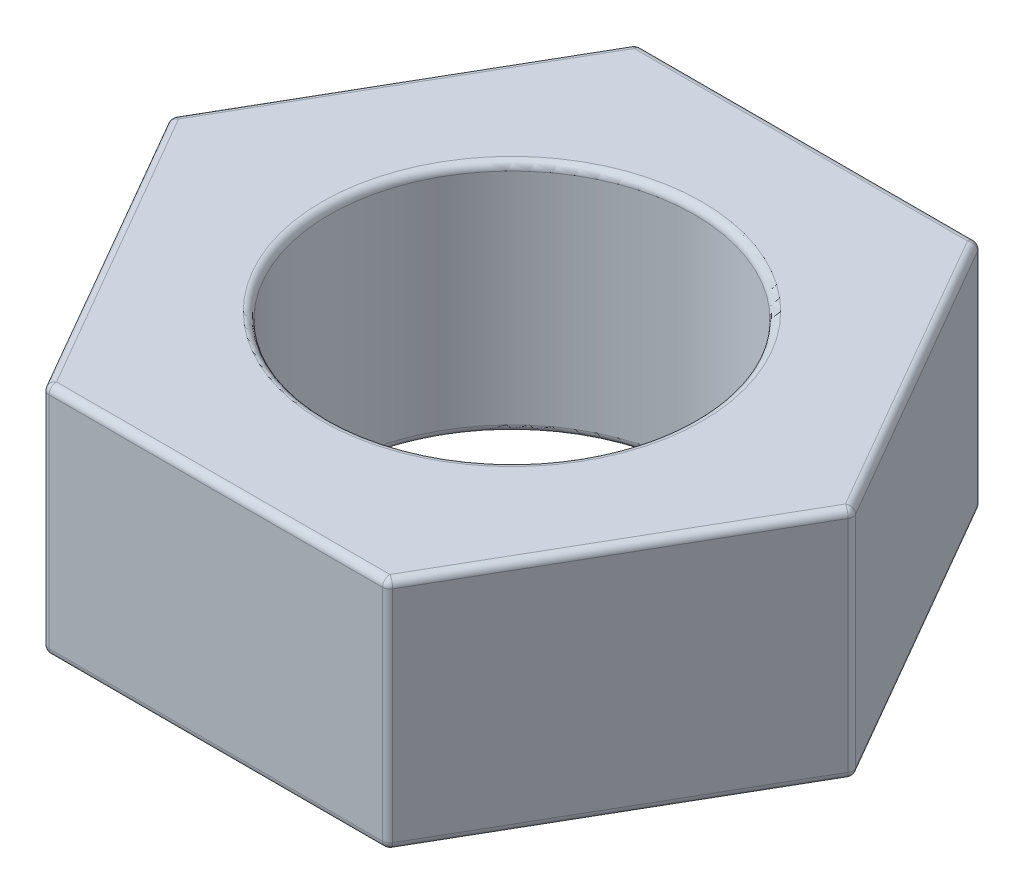
ISO-10303-21;
HEADER;
FILE_DESCRIPTION(('STEP AP214'),'2;1');
FILE_NAME('part.step','',(''),(''),'','','');
FILE_SCHEMA(('AUTOMOTIVE_DESIGN { 1 0 10303 214 1 1 1 1 }'));
ENDSEC;
DATA;
#1=APPLICATION_CONTEXT('core data for automotive mechanical design processes');
#2=APPLICATION_PROTOCOL_DEFINITION('international standard','automotive_design',2000,#1);
#3=PRODUCT_CONTEXT('',#1,'mechanical');
#4=PRODUCT('Part','Part','',(#3));
#5=PRODUCT_RELATED_PRODUCT_CATEGORY('part','',(#4));
#6=PRODUCT_DEFINITION_FORMATION('','',#4);
#7=PRODUCT_DEFINITION_CONTEXT('part definition',#1,'design');
#8=PRODUCT_DEFINITION('design','',#6,#7);
#9=PRODUCT_DEFINITION_SHAPE('','',#8);
#10=(LENGTH_UNIT() NAMED_UNIT(*) SI_UNIT(.MILLI.,.METRE.));
#11=(NAMED_UNIT(*) PLANE_ANGLE_UNIT() SI_UNIT($,.RADIAN.));
#12=(NAMED_UNIT(*) SI_UNIT($,.STERADIAN.) SOLID_ANGLE_UNIT());
#13=UNCERTAINTY_MEASURE_WITH_UNIT(LENGTH_MEASURE(1.E-05),#10,'distance_accuracy_value','');
#14=(GEOMETRIC_REPRESENTATION_CONTEXT(3) GLOBAL_UNCERTAINTY_ASSIGNED_CONTEXT((#13)) GLOBAL_UNIT_ASSIGNED_CONTEXT((#10,
#11,#12)) REPRESENTATION_CONTEXT('',''));
#15=CARTESIAN_POINT('',(0.,0.,0.));
#16=DIRECTION('',(0.,0.,1.));
#17=DIRECTION('',(1.,0.,0.));
#18=AXIS2_PLACEMENT_3D('',#15,#16,#17);
#19=CARTESIAN_POINT('',(2.2372322931098,0.0999999999999998,-3.875));
#20=DIRECTION('',(1.,0.,0.));
#21=DIRECTION('',(0.,0.,-1.));
#22=AXIS2_PLACEMENT_3D('',#19,#20,#21);
#23=SPHERICAL_SURFACE('',#22,0.1);
#24=CARTESIAN_POINT('',(2.2372322931098,0.0999999999999998,-3.875));
#25=DIRECTION('',(-1.,0.,0.));
#26=DIRECTION('',(0.,0.,1.));
#27=AXIS2_PLACEMENT_3D('',#24,#25,#26);
#28=CIRCLE('',#27,0.0999999999999998);
#29=CARTESIAN_POINT('',(2.2372322931098,0.0999999999999998,-3.975));
#30=VERTEX_POINT('',#29);
#31=CARTESIAN_POINT('',(2.2372322931098,0.,-3.875));
#32=VERTEX_POINT('',#31);
#33=EDGE_CURVE('E85',#30,#32,#28,.T.);
#34=ORIENTED_EDGE('',*,*,#33,.F.);
#35=CARTESIAN_POINT('',(2.2372322931098,0.0999999999999998,-3.875));
#36=DIRECTION('',(0.,-1.,0.));
#37=DIRECTION('',(0.,0.,-1.));
#38=AXIS2_PLACEMENT_3D('',#35,#36,#37);
#39=CIRCLE('',#38,0.0999999999999998);
#40=CARTESIAN_POINT('',(2.32383483348825,0.0999999999999998,-3.925));
#41=VERTEX_POINT('',#40);
#42=EDGE_CURVE('E199',#41,#30,#39,.F.);
#43=ORIENTED_EDGE('',*,*,#42,.F.);
#44=CARTESIAN_POINT('',(2.2372322931098,0.0999999999999998,-3.875));
#45=DIRECTION('',(-0.5,0.,-0.866025403784439));
#46=DIRECTION('',(-0.866025403784439,0.,0.5));
#47=AXIS2_PLACEMENT_3D('',#44,#45,#46);
#48=CIRCLE('',#47,0.1);
#49=EDGE_CURVE('E330',#32,#41,#48,.F.);
#50=ORIENTED_EDGE('',*,*,#49,.F.);
#51=EDGE_LOOP('',(#34,#43,#50));
#52=FACE_BOUND('',#51,.T.);
#53=ADVANCED_FACE('F16',(#52),#23,.T.);
#54=CARTESIAN_POINT('',(-2.2372322931098,0.0999999999999998,-3.875));
#55=DIRECTION('',(1.,0.,0.));
#56=DIRECTION('',(0.,0.,-1.));
#57=AXIS2_PLACEMENT_3D('',#54,#55,#56);
#58=SPHERICAL_SURFACE('',#57,0.1);
#59=CARTESIAN_POINT('',(-2.2372322931098,0.0999999999999998,-3.875));
#60=DIRECTION('',(-0.5,0.,0.866025403784439));
#61=DIRECTION('',(0.866025403784439,0.,0.5));
#62=AXIS2_PLACEMENT_3D('',#59,#60,#61);
#63=CIRCLE('',#62,0.1);
#64=CARTESIAN_POINT('',(-2.32383483348825,0.0999999999999985,-3.925));
#65=VERTEX_POINT('',#64);
#66=CARTESIAN_POINT('',(-2.2372322931098,0.,-3.875));
#67=VERTEX_POINT('',#66);
#68=EDGE_CURVE('E409',#65,#67,#63,.T.);
#69=ORIENTED_EDGE('',*,*,#68,.F.);
#70=CARTESIAN_POINT('',(-2.2372322931098,0.0999999999999998,-3.875));
#71=DIRECTION('',(0.,-1.,0.));
#72=DIRECTION('',(0.,0.,-1.));
#73=AXIS2_PLACEMENT_3D('',#70,#71,#72);
#74=CIRCLE('',#73,0.0999999999999998);
#75=CARTESIAN_POINT('',(-2.2372322931098,0.0999999999999998,-3.975));
#76=VERTEX_POINT('',#75);
#77=EDGE_CURVE('E311',#76,#65,#74,.F.);
#78=ORIENTED_EDGE('',*,*,#77,.F.);
#79=CARTESIAN_POINT('',(-2.2372322931098,0.0999999999999998,-3.875));
#80=DIRECTION('',(-1.,0.,0.));
#81=DIRECTION('',(0.,0.,1.));
#82=AXIS2_PLACEMENT_3D('',#79,#80,#81);
#83=CIRCLE('',#82,0.0999999999999998);
#84=EDGE_CURVE('E318',#67,#76,#83,.F.);
#85=ORIENTED_EDGE('',*,*,#84,.F.);
#86=EDGE_LOOP('',(#69,#78,#85));
#87=FACE_BOUND('',#86,.T.);
#88=ADVANCED_FACE('F539',(#87),#58,.T.);
#89=CARTESIAN_POINT('',(-4.4744645862196,0.0999999999999998,0.));
#90=DIRECTION('',(1.,0.,0.));
#91=DIRECTION('',(0.,0.,-1.));
#92=AXIS2_PLACEMENT_3D('',#89,#90,#91);
#93=SPHERICAL_SURFACE('',#92,0.1);
#94=CARTESIAN_POINT('',(-4.4744645862196,0.0999999999999998,0.));
#95=DIRECTION('',(0.,-1.,0.));
#96=DIRECTION('',(0.,0.,-1.));
#97=AXIS2_PLACEMENT_3D('',#94,#95,#96);
#98=CIRCLE('',#97,0.1);
#99=CARTESIAN_POINT('',(-4.5744645862196,0.0999999999999998,0.));
#100=VERTEX_POINT('',#99);
#101=CARTESIAN_POINT('',(-4.56106712659804,0.0999999999999998,0.0499999999999995));
#102=VERTEX_POINT('',#101);
#103=EDGE_CURVE('E37',#100,#102,#98,.F.);
#104=ORIENTED_EDGE('',*,*,#103,.F.);
#105=CARTESIAN_POINT('',(-4.4744645862196,0.0999999999999998,0.));
#106=DIRECTION('',(0.,-1.,0.));
#107=DIRECTION('',(0.,0.,-1.));
#108=AXIS2_PLACEMENT_3D('',#105,#106,#107);
#109=CIRCLE('',#108,0.1);
#110=CARTESIAN_POINT('',(-4.56106712659804,0.099999999999999,-0.0499999999999993));
#111=VERTEX_POINT('',#110);
#112=EDGE_CURVE('E296',#111,#100,#109,.F.);
#113=ORIENTED_EDGE('',*,*,#112,.F.);
#114=CARTESIAN_POINT('',(-4.4744645862196,0.0999999999999998,0.));
#115=DIRECTION('',(-0.5,0.,0.866025403784439));
#116=DIRECTION('',(0.866025403784439,0.,0.5));
#117=AXIS2_PLACEMENT_3D('',#114,#115,#116);
#118=CIRCLE('',#117,0.1);
#119=CARTESIAN_POINT('',(-4.4744645862196,0.,0.));
#120=VERTEX_POINT('',#119);
#121=EDGE_CURVE('E412',#120,#111,#118,.F.);
#122=ORIENTED_EDGE('',*,*,#121,.F.);
#123=CARTESIAN_POINT('',(-4.4744645862196,0.0999999999999998,0.));
#124=DIRECTION('',(0.5,0.,0.866025403784439));
#125=DIRECTION('',(0.866025403784439,0.,-0.5));
#126=AXIS2_PLACEMENT_3D('',#123,#124,#125);
#127=CIRCLE('',#126,0.1);
#128=EDGE_CURVE('E406',#102,#120,#127,.T.);
#129=ORIENTED_EDGE('',*,*,#128,.F.);
#130=EDGE_LOOP('',(#104,#113,#122,#129));
#131=FACE_BOUND('',#130,.T.);
#132=ADVANCED_FACE('F630',(#131),#93,.T.);
#133=CARTESIAN_POINT('',(-2.2372322931098,0.0999999999999998,3.875));
#134=DIRECTION('',(1.,0.,0.));
#135=DIRECTION('',(0.,0.,-1.));
#136=AXIS2_PLACEMENT_3D('',#133,#134,#135);
#137=SPHERICAL_SURFACE('',#136,0.1);
#138=CARTESIAN_POINT('',(-2.2372322931098,0.0999999999999998,3.875));
#139=DIRECTION('',(1.,0.,0.));
#140=DIRECTION('',(0.,0.,-1.));
#141=AXIS2_PLACEMENT_3D('',#138,#139,#140);
#142=CIRCLE('',#141,0.0999999999999998);
#143=CARTESIAN_POINT('',(-2.2372322931098,0.0999999999999998,3.975));
#144=VERTEX_POINT('',#143);
#145=CARTESIAN_POINT('',(-2.2372322931098,0.,3.875));
#146=VERTEX_POINT('',#145);
#147=EDGE_CURVE('E286',#144,#146,#142,.T.);
#148=ORIENTED_EDGE('',*,*,#147,.F.);
#149=CARTESIAN_POINT('',(-2.2372322931098,0.0999999999999998,3.875));
#150=DIRECTION('',(0.,-1.,0.));
#151=DIRECTION('',(0.,0.,-1.));
#152=AXIS2_PLACEMENT_3D('',#149,#150,#151);
#153=CIRCLE('',#152,0.0999999999999998);
#154=CARTESIAN_POINT('',(-2.32383483348824,0.0999999999999998,3.925));
#155=VERTEX_POINT('',#154);
#156=EDGE_CURVE('E273',#155,#144,#153,.F.);
#157=ORIENTED_EDGE('',*,*,#156,.F.);
#158=CARTESIAN_POINT('',(-2.2372322931098,0.0999999999999998,3.875));
#159=DIRECTION('',(0.5,0.,0.866025403784439));
#160=DIRECTION('',(0.866025403784439,0.,-0.5));
#161=AXIS2_PLACEMENT_3D('',#158,#159,#160);
#162=CIRCLE('',#161,0.1);
#163=EDGE_CURVE('E298',#146,#155,#162,.F.);
#164=ORIENTED_EDGE('',*,*,#163,.F.);
#165=EDGE_LOOP('',(#148,#157,#164));
#166=FACE_BOUND('',#165,.T.);
#167=ADVANCED_FACE('F617',(#166),#137,.T.);
#168=CARTESIAN_POINT('',(0.,0.,0.));
#169=DIRECTION('',(0.,1.,0.));
#170=DIRECTION('',(0.,0.,1.));
#171=AXIS2_PLACEMENT_3D('',#168,#169,#170);
#172=PLANE('',#171);
#173=DIRECTION('',(0.5,0.,0.866025403784439));
#174=VECTOR('',#173,1.);
#175=CARTESIAN_POINT('',(-4.50333209967908,0.,-0.0499999999999997));
#176=LINE('',#175,#174);
#177=EDGE_CURVE('E405',#120,#146,#176,.T.);
#178=ORIENTED_EDGE('',*,*,#177,.F.);
#179=DIRECTION('',(-0.5,0.,0.866025403784439));
#180=VECTOR('',#179,1.);
#181=CARTESIAN_POINT('',(-2.20836477965032,0.,-3.925));
#182=LINE('',#181,#180);
#183=EDGE_CURVE('E310',#67,#120,#182,.T.);
#184=ORIENTED_EDGE('',*,*,#183,.F.);
#185=DIRECTION('',(-1.,0.,0.));
#186=VECTOR('',#185,1.);
#187=CARTESIAN_POINT('',(2.29496732002876,0.,-3.875));
#188=LINE('',#187,#186);
#189=EDGE_CURVE('E198',#32,#67,#188,.T.);
#190=ORIENTED_EDGE('',*,*,#189,.F.);
#191=DIRECTION('',(-0.5,0.,-0.866025403784439));
#192=VECTOR('',#191,1.);
#193=CARTESIAN_POINT('',(4.50333209967908,0.,0.049999999999999));
#194=LINE('',#193,#192);
#195=CARTESIAN_POINT('',(4.4744645862196,0.,0.));
#196=VERTEX_POINT('',#195);
#197=EDGE_CURVE('E417',#196,#32,#194,.T.);
#198=ORIENTED_EDGE('',*,*,#197,.F.);
#199=DIRECTION('',(0.5,0.,-0.866025403784439));
#200=VECTOR('',#199,1.);
#201=CARTESIAN_POINT('',(2.20836477965032,0.,3.925));
#202=LINE('',#201,#200);
#203=CARTESIAN_POINT('',(2.2372322931098,0.,3.875));
#204=VERTEX_POINT('',#203);
#205=EDGE_CURVE('E395',#204,#196,#202,.T.);
#206=ORIENTED_EDGE('',*,*,#205,.F.);
#207=DIRECTION('',(1.,0.,0.));
#208=VECTOR('',#207,1.);
#209=CARTESIAN_POINT('',(-2.29496732002876,0.,3.875));
#210=LINE('',#209,#208);
#211=EDGE_CURVE('E289',#146,#204,#210,.T.);
#212=ORIENTED_EDGE('',*,*,#211,.F.);
#213=EDGE_LOOP('',(#178,#184,#190,#198,#206,#212));
#214=FACE_BOUND('',#213,.T.);
#215=CARTESIAN_POINT('',(0.,0.,0.));
#216=DIRECTION('',(0.,-1.,0.));
#217=DIRECTION('',(0.,0.,1.));
#218=AXIS2_PLACEMENT_3D('',#215,#216,#217);
#219=CIRCLE('',#218,2.55);
#220=CARTESIAN_POINT('',(0.,0.,2.55));
#221=VERTEX_POINT('',#220);
#222=CARTESIAN_POINT('',(0.,0.,-2.55));
#223=VERTEX_POINT('',#222);
#224=EDGE_CURVE('E985',#221,#223,#219,.T.);
#225=ORIENTED_EDGE('',*,*,#224,.F.);
#226=CARTESIAN_POINT('',(0.,0.,0.));
#227=DIRECTION('',(0.,-1.,0.));
#228=DIRECTION('',(0.,0.,-1.));
#229=AXIS2_PLACEMENT_3D('',#226,#227,#228);
#230=CIRCLE('',#229,2.55);
#231=EDGE_CURVE('E418',#223,#221,#230,.T.);
#232=ORIENTED_EDGE('',*,*,#231,.F.);
#233=EDGE_LOOP('',(#225,#232));
#234=FACE_BOUND('',#233,.T.);
#235=ADVANCED_FACE('F544',(#214,#234),#172,.F.);
#236=CARTESIAN_POINT('',(4.4744645862196,0.0999999999999998,0.));
#237=DIRECTION('',(1.,0.,0.));
#238=DIRECTION('',(0.,0.,-1.));
#239=AXIS2_PLACEMENT_3D('',#236,#237,#238);
#240=SPHERICAL_SURFACE('',#239,0.1);
#241=CARTESIAN_POINT('',(4.4744645862196,0.0999999999999998,0.));
#242=DIRECTION('',(0.,-1.,0.));
#243=DIRECTION('',(0.,0.,-1.));
#244=AXIS2_PLACEMENT_3D('',#241,#242,#243);
#245=CIRCLE('',#244,0.1);
#246=CARTESIAN_POINT('',(4.5744645862196,0.0999999999999998,0.));
#247=VERTEX_POINT('',#246);
#248=CARTESIAN_POINT('',(4.56106712659804,0.0999999999999998,-0.0499999999999997));
#249=VERTEX_POINT('',#248);
#250=EDGE_CURVE('E269',#247,#249,#245,.F.);
#251=ORIENTED_EDGE('',*,*,#250,.F.);
#252=CARTESIAN_POINT('',(4.4744645862196,0.0999999999999998,0.));
#253=DIRECTION('',(0.,-1.,0.));
#254=DIRECTION('',(0.,0.,-1.));
#255=AXIS2_PLACEMENT_3D('',#252,#253,#254);
#256=CIRCLE('',#255,0.1);
#257=CARTESIAN_POINT('',(4.56106712659804,0.099999999999999,0.0499999999999999));
#258=VERTEX_POINT('',#257);
#259=EDGE_CURVE('E270',#258,#247,#256,.F.);
#260=ORIENTED_EDGE('',*,*,#259,.F.);
#261=CARTESIAN_POINT('',(4.4744645862196,0.0999999999999998,0.));
#262=DIRECTION('',(0.5,0.,-0.866025403784439));
#263=DIRECTION('',(-0.866025403784439,0.,-0.5));
#264=AXIS2_PLACEMENT_3D('',#261,#262,#263);
#265=CIRCLE('',#264,0.0999999999999999);
#266=EDGE_CURVE('E260',#196,#258,#265,.F.);
#267=ORIENTED_EDGE('',*,*,#266,.F.);
#268=CARTESIAN_POINT('',(4.4744645862196,0.0999999999999998,0.));
#269=DIRECTION('',(-0.5,0.,-0.866025403784439));
#270=DIRECTION('',(-0.866025403784439,0.,0.5));
#271=AXIS2_PLACEMENT_3D('',#268,#269,#270);
#272=CIRCLE('',#271,0.1);
#273=EDGE_CURVE('E79',#249,#196,#272,.T.);
#274=ORIENTED_EDGE('',*,*,#273,.F.);
#275=EDGE_LOOP('',(#251,#260,#267,#274));
#276=FACE_BOUND('',#275,.T.);
#277=ADVANCED_FACE('F564',(#276),#240,.T.);
#278=CARTESIAN_POINT('',(2.2372322931098,0.0999999999999998,3.875));
#279=DIRECTION('',(1.,0.,0.));
#280=DIRECTION('',(0.,0.,-1.));
#281=AXIS2_PLACEMENT_3D('',#278,#279,#280);
#282=SPHERICAL_SURFACE('',#281,0.1);
#283=CARTESIAN_POINT('',(2.2372322931098,0.0999999999999998,3.875));
#284=DIRECTION('',(0.5,0.,-0.866025403784439));
#285=DIRECTION('',(-0.866025403784439,0.,-0.5));
#286=AXIS2_PLACEMENT_3D('',#283,#284,#285);
#287=CIRCLE('',#286,0.0999999999999999);
#288=CARTESIAN_POINT('',(2.32383483348824,0.0999999999999985,3.925));
#289=VERTEX_POINT('',#288);
#290=EDGE_CURVE('E396',#289,#204,#287,.T.);
#291=ORIENTED_EDGE('',*,*,#290,.F.);
#292=CARTESIAN_POINT('',(2.2372322931098,0.0999999999999998,3.875));
#293=DIRECTION('',(0.,-1.,0.));
#294=DIRECTION('',(0.,0.,-1.));
#295=AXIS2_PLACEMENT_3D('',#292,#293,#294);
#296=CIRCLE('',#295,0.0999999999999998);
#297=CARTESIAN_POINT('',(2.2372322931098,0.0999999999999998,3.975));
#298=VERTEX_POINT('',#297);
#299=EDGE_CURVE('E257',#298,#289,#296,.F.);
#300=ORIENTED_EDGE('',*,*,#299,.F.);
#301=CARTESIAN_POINT('',(2.2372322931098,0.0999999999999998,3.875));
#302=DIRECTION('',(1.,0.,0.));
#303=DIRECTION('',(0.,0.,-1.));
#304=AXIS2_PLACEMENT_3D('',#301,#302,#303);
#305=CIRCLE('',#304,0.0999999999999998);
#306=EDGE_CURVE('E276',#204,#298,#305,.F.);
#307=ORIENTED_EDGE('',*,*,#306,.F.);
#308=EDGE_LOOP('',(#291,#300,#307));
#309=FACE_BOUND('',#308,.T.);
#310=ADVANCED_FACE('F349',(#309),#282,.T.);
#311=CARTESIAN_POINT('',(0.,0.0999999999999998,0.));
#312=DIRECTION('',(0.,1.,0.));
#313=DIRECTION('',(0.,0.,1.));
#314=AXIS2_PLACEMENT_3D('',#311,#312,#313);
#315=TOROIDAL_SURFACE('',#314,2.55,0.1);
#316=ORIENTED_EDGE('',*,*,#224,.T.);
#317=ORIENTED_EDGE('',*,*,#231,.T.);
#318=EDGE_LOOP('',(#316,#317));
#319=FACE_BOUND('',#318,.T.);
#320=CARTESIAN_POINT('',(0.,0.0999999999999998,0.));
#321=DIRECTION('',(0.,-1.,0.));
#322=DIRECTION('',(0.,0.,-1.));
#323=AXIS2_PLACEMENT_3D('',#320,#321,#322);
#324=CIRCLE('',#323,2.45);
#325=CARTESIAN_POINT('',(0.,0.0999999999999998,-2.45));
#326=VERTEX_POINT('',#325);
#327=EDGE_CURVE('E250',#326,#326,#324,.F.);
#328=ORIENTED_EDGE('',*,*,#327,.T.);
#329=EDGE_LOOP('',(#328));
#330=FACE_BOUND('',#329,.T.);
#331=ADVANCED_FACE('F343',(#319,#330),#315,.T.);
#332=CARTESIAN_POINT('',(4.50333209967908,0.0999999999999998,0.0499999999999996));
#333=DIRECTION('',(-0.5,0.,-0.866025403784439));
#334=DIRECTION('',(-0.866025403784439,0.,0.5));
#335=AXIS2_PLACEMENT_3D('',#332,#333,#334);
#336=CYLINDRICAL_SURFACE('',#335,0.1);
#337=ORIENTED_EDGE('',*,*,#197,.T.);
#338=ORIENTED_EDGE('',*,*,#49,.T.);
#339=DIRECTION('',(0.5,0.,0.866025403784439));
#340=VECTOR('',#339,1.);
#341=CARTESIAN_POINT('',(4.58993464005752,0.0999999999999998,0.));
#342=LINE('',#341,#340);
#343=EDGE_CURVE('E249',#41,#249,#342,.T.);
#344=ORIENTED_EDGE('',*,*,#343,.T.);
#345=ORIENTED_EDGE('',*,*,#273,.T.);
#346=EDGE_LOOP('',(#337,#338,#344,#345));
#347=FACE_BOUND('',#346,.T.);
#348=ADVANCED_FACE('F348',(#347),#336,.T.);
#349=CARTESIAN_POINT('',(2.2372322931098,3.15,-3.875));
#350=DIRECTION('',(0.,-1.,0.));
#351=DIRECTION('',(0.,0.,-1.));
#352=AXIS2_PLACEMENT_3D('',#349,#350,#351);
#353=CYLINDRICAL_SURFACE('',#352,0.0999999999999998);
#354=CARTESIAN_POINT('',(2.2372322931098,3.05,-3.875));
#355=DIRECTION('',(0.,-1.,0.));
#356=DIRECTION('',(0.,0.,-1.));
#357=AXIS2_PLACEMENT_3D('',#354,#355,#356);
#358=CIRCLE('',#357,0.0999999999999998);
#359=CARTESIAN_POINT('',(2.2372322931098,3.05,-3.975));
#360=VERTEX_POINT('',#359);
#361=CARTESIAN_POINT('',(2.32383483348825,3.05,-3.925));
#362=VERTEX_POINT('',#361);
#363=EDGE_CURVE('E187',#360,#362,#358,.T.);
#364=ORIENTED_EDGE('',*,*,#363,.T.);
#365=DIRECTION('',(0.,1.,0.));
#366=VECTOR('',#365,1.);
#367=CARTESIAN_POINT('',(2.32383483348825,3.15,-3.925));
#368=LINE('',#367,#366);
#369=EDGE_CURVE('E247',#362,#41,#368,.F.);
#370=ORIENTED_EDGE('',*,*,#369,.T.);
#371=ORIENTED_EDGE('',*,*,#42,.T.);
#372=DIRECTION('',(0.,1.,0.));
#373=VECTOR('',#372,1.);
#374=CARTESIAN_POINT('',(2.2372322931098,3.15,-3.975));
#375=LINE('',#374,#373);
#376=EDGE_CURVE('E202',#30,#360,#375,.T.);
#377=ORIENTED_EDGE('',*,*,#376,.T.);
#378=EDGE_LOOP('',(#364,#370,#371,#377));
#379=FACE_BOUND('',#378,.T.);
#380=ADVANCED_FACE('F204',(#379),#353,.T.);
#381=CARTESIAN_POINT('',(2.29496732002876,0.0999999999999998,-3.875));
#382=DIRECTION('',(-1.,0.,0.));
#383=DIRECTION('',(0.,0.,1.));
#384=AXIS2_PLACEMENT_3D('',#381,#382,#383);
#385=CYLINDRICAL_SURFACE('',#384,0.0999999999999998);
#386=DIRECTION('',(1.,0.,0.));
#387=VECTOR('',#386,1.);
#388=CARTESIAN_POINT('',(2.29496732002876,0.0999999999999998,-3.975));
#389=LINE('',#388,#387);
#390=EDGE_CURVE('E241',#76,#30,#389,.T.);
#391=ORIENTED_EDGE('',*,*,#390,.T.);
#392=ORIENTED_EDGE('',*,*,#33,.T.);
#393=ORIENTED_EDGE('',*,*,#189,.T.);
#394=ORIENTED_EDGE('',*,*,#84,.T.);
#395=EDGE_LOOP('',(#391,#392,#393,#394));
#396=FACE_BOUND('',#395,.T.);
#397=ADVANCED_FACE('F552',(#396),#385,.T.);
#398=CARTESIAN_POINT('',(-2.2372322931098,3.15,-3.875));
#399=DIRECTION('',(0.,-1.,0.));
#400=DIRECTION('',(0.,0.,-1.));
#401=AXIS2_PLACEMENT_3D('',#398,#399,#400);
#402=CYLINDRICAL_SURFACE('',#401,0.0999999999999998);
#403=CARTESIAN_POINT('',(-2.2372322931098,3.05,-3.875));
#404=DIRECTION('',(0.,-1.,0.));
#405=DIRECTION('',(0.,0.,-1.));
#406=AXIS2_PLACEMENT_3D('',#403,#404,#405);
#407=CIRCLE('',#406,0.0999999999999998);
#408=CARTESIAN_POINT('',(-2.32383483348824,3.05,-3.925));
#409=VERTEX_POINT('',#408);
#410=CARTESIAN_POINT('',(-2.2372322931098,3.05,-3.975));
#411=VERTEX_POINT('',#410);
#412=EDGE_CURVE('E182',#409,#411,#407,.T.);
#413=ORIENTED_EDGE('',*,*,#412,.T.);
#414=DIRECTION('',(0.,1.,0.));
#415=VECTOR('',#414,1.);
#416=CARTESIAN_POINT('',(-2.2372322931098,3.15,-3.975));
#417=LINE('',#416,#415);
#418=EDGE_CURVE('E208',#411,#76,#417,.F.);
#419=ORIENTED_EDGE('',*,*,#418,.T.);
#420=ORIENTED_EDGE('',*,*,#77,.T.);
#421=DIRECTION('',(0.,1.,0.));
#422=VECTOR('',#421,1.);
#423=CARTESIAN_POINT('',(-2.32383483348825,3.15,-3.925));
#424=LINE('',#423,#422);
#425=EDGE_CURVE('E324',#65,#409,#424,.T.);
#426=ORIENTED_EDGE('',*,*,#425,.T.);
#427=EDGE_LOOP('',(#413,#419,#420,#426));
#428=FACE_BOUND('',#427,.T.);
#429=ADVANCED_FACE('F537',(#428),#402,.T.);
#430=CARTESIAN_POINT('',(-2.20836477965032,0.0999999999999998,-3.925));
#431=DIRECTION('',(-0.5,0.,0.866025403784439));
#432=DIRECTION('',(0.866025403784439,0.,0.5));
#433=AXIS2_PLACEMENT_3D('',#430,#431,#432);
#434=CYLINDRICAL_SURFACE('',#433,0.1);
#435=DIRECTION('',(0.5,0.,-0.866025403784439));
#436=VECTOR('',#435,1.);
#437=CARTESIAN_POINT('',(-2.29496732002876,0.0999999999999981,-3.975));
#438=LINE('',#437,#436);
#439=EDGE_CURVE('E304',#111,#65,#438,.T.);
#440=ORIENTED_EDGE('',*,*,#439,.T.);
#441=ORIENTED_EDGE('',*,*,#68,.T.);
#442=ORIENTED_EDGE('',*,*,#183,.T.);
#443=ORIENTED_EDGE('',*,*,#121,.T.);
#444=EDGE_LOOP('',(#440,#441,#442,#443));
#445=FACE_BOUND('',#444,.T.);
#446=ADVANCED_FACE('F534',(#445),#434,.T.);
#447=CARTESIAN_POINT('',(-4.50333209967908,0.0999999999999998,-0.05));
#448=DIRECTION('',(0.5,0.,0.866025403784439));
#449=DIRECTION('',(0.866025403784439,0.,-0.5));
#450=AXIS2_PLACEMENT_3D('',#447,#448,#449);
#451=CYLINDRICAL_SURFACE('',#450,0.1);
#452=ORIENTED_EDGE('',*,*,#177,.T.);
#453=ORIENTED_EDGE('',*,*,#163,.T.);
#454=DIRECTION('',(-0.5,0.,-0.866025403784439));
#455=VECTOR('',#454,1.);
#456=CARTESIAN_POINT('',(-4.58993464005752,0.0999999999999998,0.));
#457=LINE('',#456,#455);
#458=EDGE_CURVE('E299',#155,#102,#457,.T.);
#459=ORIENTED_EDGE('',*,*,#458,.T.);
#460=ORIENTED_EDGE('',*,*,#128,.T.);
#461=EDGE_LOOP('',(#452,#453,#459,#460));
#462=FACE_BOUND('',#461,.T.);
#463=ADVANCED_FACE('F615',(#462),#451,.T.);
#464=CARTESIAN_POINT('',(-4.4744645862196,3.15,0.));
#465=DIRECTION('',(0.,-1.,0.));
#466=DIRECTION('',(0.,0.,-1.));
#467=AXIS2_PLACEMENT_3D('',#464,#465,#466);
#468=CYLINDRICAL_SURFACE('',#467,0.1);
#469=CARTESIAN_POINT('',(-4.4744645862196,3.05,0.));
#470=DIRECTION('',(0.,-1.,0.));
#471=DIRECTION('',(0.,0.,-1.));
#472=AXIS2_PLACEMENT_3D('',#469,#470,#471);
#473=CIRCLE('',#472,0.1);
#474=CARTESIAN_POINT('',(-4.56106712659804,3.05,-0.0500000000000001));
#475=VERTEX_POINT('',#474);
#476=CARTESIAN_POINT('',(-4.5744645862196,3.05,0.));
#477=VERTEX_POINT('',#476);
#478=EDGE_CURVE('E307',#475,#477,#473,.F.);
#479=ORIENTED_EDGE('',*,*,#478,.F.);
#480=DIRECTION('',(0.,1.,0.));
#481=VECTOR('',#480,1.);
#482=CARTESIAN_POINT('',(-4.56106712659804,3.15,-0.0500000000000006));
#483=LINE('',#482,#481);
#484=EDGE_CURVE('E308',#475,#111,#483,.F.);
#485=ORIENTED_EDGE('',*,*,#484,.T.);
#486=ORIENTED_EDGE('',*,*,#112,.T.);
#487=ORIENTED_EDGE('',*,*,#103,.T.);
#488=DIRECTION('',(0.,1.,0.));
#489=VECTOR('',#488,1.);
#490=CARTESIAN_POINT('',(-4.56106712659804,3.15,0.0499999999999994));
#491=LINE('',#490,#489);
#492=CARTESIAN_POINT('',(-4.56106712659804,3.05000000000001,0.0499999999999994));
#493=VERTEX_POINT('',#492);
#494=EDGE_CURVE('E302',#102,#493,#491,.T.);
#495=ORIENTED_EDGE('',*,*,#494,.T.);
#496=CARTESIAN_POINT('',(-4.4744645862196,3.05,0.));
#497=DIRECTION('',(0.,-1.,5.17930483365088E-13));
#498=DIRECTION('',(1.,0.,0.));
#499=AXIS2_PLACEMENT_3D('',#496,#497,#498);
#500=CIRCLE('',#499,0.1);
#501=EDGE_CURVE('E392',#477,#493,#500,.F.);
#502=ORIENTED_EDGE('',*,*,#501,.F.);
#503=EDGE_LOOP('',(#479,#485,#486,#487,#495,#502));
#504=FACE_BOUND('',#503,.T.);
#505=ADVANCED_FACE('F527',(#504),#468,.T.);
#506=CARTESIAN_POINT('',(-2.29496732002876,0.0999999999999998,3.875));
#507=DIRECTION('',(1.,0.,0.));
#508=DIRECTION('',(0.,0.,-1.));
#509=AXIS2_PLACEMENT_3D('',#506,#507,#508);
#510=CYLINDRICAL_SURFACE('',#509,0.0999999999999998);
#511=ORIENTED_EDGE('',*,*,#211,.T.);
#512=ORIENTED_EDGE('',*,*,#306,.T.);
#513=DIRECTION('',(-1.,0.,0.));
#514=VECTOR('',#513,1.);
#515=CARTESIAN_POINT('',(-2.29496732002876,0.0999999999999998,3.975));
#516=LINE('',#515,#514);
#517=EDGE_CURVE('E279',#298,#144,#516,.T.);
#518=ORIENTED_EDGE('',*,*,#517,.T.);
#519=ORIENTED_EDGE('',*,*,#147,.T.);
#520=EDGE_LOOP('',(#511,#512,#518,#519));
#521=FACE_BOUND('',#520,.T.);
#522=ADVANCED_FACE('F619',(#521),#510,.T.);
#523=CARTESIAN_POINT('',(-2.2372322931098,3.15,3.875));
#524=DIRECTION('',(0.,-1.,0.));
#525=DIRECTION('',(0.,0.,-1.));
#526=AXIS2_PLACEMENT_3D('',#523,#524,#525);
#527=CYLINDRICAL_SURFACE('',#526,0.0999999999999998);
#528=CARTESIAN_POINT('',(-2.2372322931098,3.05,3.875));
#529=DIRECTION('',(0.,-1.,0.));
#530=DIRECTION('',(1.,0.,0.));
#531=AXIS2_PLACEMENT_3D('',#528,#529,#530);
#532=CIRCLE('',#531,0.1);
#533=CARTESIAN_POINT('',(-2.32383483348824,3.05,3.925));
#534=VERTEX_POINT('',#533);
#535=CARTESIAN_POINT('',(-2.2372322931098,3.05,3.975));
#536=VERTEX_POINT('',#535);
#537=EDGE_CURVE('E491',#534,#536,#532,.F.);
#538=ORIENTED_EDGE('',*,*,#537,.F.);
#539=DIRECTION('',(0.,1.,0.));
#540=VECTOR('',#539,1.);
#541=CARTESIAN_POINT('',(-2.32383483348824,3.15,3.925));
#542=LINE('',#541,#540);
#543=EDGE_CURVE('E303',#534,#155,#542,.F.);
#544=ORIENTED_EDGE('',*,*,#543,.T.);
#545=ORIENTED_EDGE('',*,*,#156,.T.);
#546=DIRECTION('',(0.,1.,0.));
#547=VECTOR('',#546,1.);
#548=CARTESIAN_POINT('',(-2.2372322931098,3.15,3.975));
#549=LINE('',#548,#547);
#550=EDGE_CURVE('E282',#144,#536,#549,.T.);
#551=ORIENTED_EDGE('',*,*,#550,.T.);
#552=EDGE_LOOP('',(#538,#544,#545,#551));
#553=FACE_BOUND('',#552,.T.);
#554=ADVANCED_FACE('F612',(#553),#527,.T.);
#555=CARTESIAN_POINT('',(4.4744645862196,3.15,0.));
#556=DIRECTION('',(0.,-1.,0.));
#557=DIRECTION('',(0.,0.,-1.));
#558=AXIS2_PLACEMENT_3D('',#555,#556,#557);
#559=CYLINDRICAL_SURFACE('',#558,0.1);
#560=CARTESIAN_POINT('',(4.4744645862196,3.05,0.));
#561=DIRECTION('',(0.,-1.,0.));
#562=DIRECTION('',(0.,0.,-1.));
#563=AXIS2_PLACEMENT_3D('',#560,#561,#562);
#564=CIRCLE('',#563,0.1);
#565=CARTESIAN_POINT('',(4.5744645862196,3.05,0.));
#566=VERTEX_POINT('',#565);
#567=CARTESIAN_POINT('',(4.56106712659804,3.05,0.0499999999999997));
#568=VERTEX_POINT('',#567);
#569=EDGE_CURVE('E158',#566,#568,#564,.T.);
#570=ORIENTED_EDGE('',*,*,#569,.T.);
#571=DIRECTION('',(0.,1.,0.));
#572=VECTOR('',#571,1.);
#573=CARTESIAN_POINT('',(4.56106712659804,3.15,0.0499999999999997));
#574=LINE('',#573,#572);
#575=EDGE_CURVE('E266',#568,#258,#574,.F.);
#576=ORIENTED_EDGE('',*,*,#575,.T.);
#577=ORIENTED_EDGE('',*,*,#259,.T.);
#578=ORIENTED_EDGE('',*,*,#250,.T.);
#579=DIRECTION('',(0.,1.,0.));
#580=VECTOR('',#579,1.);
#581=CARTESIAN_POINT('',(4.56106712659804,3.15,-0.0499999999999997));
#582=LINE('',#581,#580);
#583=CARTESIAN_POINT('',(4.56106712659804,3.05,-0.0499999999999991));
#584=VERTEX_POINT('',#583);
#585=EDGE_CURVE('E209',#249,#584,#582,.T.);
#586=ORIENTED_EDGE('',*,*,#585,.T.);
#587=CARTESIAN_POINT('',(4.4744645862196,3.05,0.));
#588=DIRECTION('',(0.,-1.,0.));
#589=DIRECTION('',(0.,0.,-1.));
#590=AXIS2_PLACEMENT_3D('',#587,#588,#589);
#591=CIRCLE('',#590,0.1);
#592=EDGE_CURVE('E267',#584,#566,#591,.T.);
#593=ORIENTED_EDGE('',*,*,#592,.T.);
#594=EDGE_LOOP('',(#570,#576,#577,#578,#586,#593));
#595=FACE_BOUND('',#594,.T.);
#596=ADVANCED_FACE('F565',(#595),#559,.T.);
#597=CARTESIAN_POINT('',(2.20836477965032,0.0999999999999998,3.925));
#598=DIRECTION('',(0.5,0.,-0.866025403784439));
#599=DIRECTION('',(-0.866025403784439,0.,-0.5));
#600=AXIS2_PLACEMENT_3D('',#597,#598,#599);
#601=CYLINDRICAL_SURFACE('',#600,0.0999999999999999);
#602=ORIENTED_EDGE('',*,*,#205,.T.);
#603=ORIENTED_EDGE('',*,*,#266,.T.);
#604=DIRECTION('',(-0.5,0.,0.866025403784439));
#605=VECTOR('',#604,1.);
#606=CARTESIAN_POINT('',(2.29496732002876,0.0999999999999981,3.975));
#607=LINE('',#606,#605);
#608=EDGE_CURVE('E263',#258,#289,#607,.T.);
#609=ORIENTED_EDGE('',*,*,#608,.T.);
#610=ORIENTED_EDGE('',*,*,#290,.T.);
#611=EDGE_LOOP('',(#602,#603,#609,#610));
#612=FACE_BOUND('',#611,.T.);
#613=ADVANCED_FACE('F561',(#612),#601,.T.);
#614=CARTESIAN_POINT('',(2.2372322931098,3.15,3.875));
#615=DIRECTION('',(0.,-1.,0.));
#616=DIRECTION('',(0.,0.,-1.));
#617=AXIS2_PLACEMENT_3D('',#614,#615,#616);
#618=CYLINDRICAL_SURFACE('',#617,0.0999999999999998);
#619=CARTESIAN_POINT('',(2.2372322931098,3.05,3.875));
#620=DIRECTION('',(0.,-1.,0.));
#621=DIRECTION('',(1.,0.,0.));
#622=AXIS2_PLACEMENT_3D('',#619,#620,#621);
#623=CIRCLE('',#622,0.1);
#624=CARTESIAN_POINT('',(2.2372322931098,3.05,3.975));
#625=VERTEX_POINT('',#624);
#626=CARTESIAN_POINT('',(2.32383483348824,3.05,3.925));
#627=VERTEX_POINT('',#626);
#628=EDGE_CURVE('E464',#625,#627,#623,.F.);
#629=ORIENTED_EDGE('',*,*,#628,.F.);
#630=DIRECTION('',(0.,1.,0.));
#631=VECTOR('',#630,1.);
#632=CARTESIAN_POINT('',(2.2372322931098,3.15,3.975));
#633=LINE('',#632,#631);
#634=EDGE_CURVE('E283',#625,#298,#633,.F.);
#635=ORIENTED_EDGE('',*,*,#634,.T.);
#636=ORIENTED_EDGE('',*,*,#299,.T.);
#637=DIRECTION('',(0.,1.,0.));
#638=VECTOR('',#637,1.);
#639=CARTESIAN_POINT('',(2.32383483348824,3.15,3.925));
#640=LINE('',#639,#638);
#641=EDGE_CURVE('E256',#289,#627,#640,.T.);
#642=ORIENTED_EDGE('',*,*,#641,.T.);
#643=EDGE_LOOP('',(#629,#635,#636,#642));
#644=FACE_BOUND('',#643,.T.);
#645=ADVANCED_FACE('F687',(#644),#618,.T.);
#646=CARTESIAN_POINT('',(0.,3.15,0.));
#647=DIRECTION('',(0.,-1.,0.));
#648=DIRECTION('',(0.,0.,-1.));
#649=AXIS2_PLACEMENT_3D('',#646,#647,#648);
#650=CYLINDRICAL_SURFACE('',#649,2.45);
#651=CARTESIAN_POINT('',(0.,3.05,0.));
#652=DIRECTION('',(0.,1.,0.));
#653=DIRECTION('',(0.,0.,1.));
#654=AXIS2_PLACEMENT_3D('',#651,#652,#653);
#655=CIRCLE('',#654,2.45);
#656=CARTESIAN_POINT('',(0.,3.05,2.45));
#657=VERTEX_POINT('',#656);
#658=EDGE_CURVE('E253',#657,#657,#655,.F.);
#659=ORIENTED_EDGE('',*,*,#658,.F.);
#660=EDGE_LOOP('',(#659));
#661=FACE_BOUND('',#660,.T.);
#662=ORIENTED_EDGE('',*,*,#327,.F.);
#663=EDGE_LOOP('',(#662));
#664=FACE_BOUND('',#663,.T.);
#665=ADVANCED_FACE('F680',(#661,#664),#650,.F.);
#666=CARTESIAN_POINT('',(4.58993464005752,3.15,0.));
#667=DIRECTION('',(-0.866025403784439,0.,0.5));
#668=DIRECTION('',(0.5,0.,0.866025403784439));
#669=AXIS2_PLACEMENT_3D('',#666,#667,#668);
#670=PLANE('',#669);
#671=ORIENTED_EDGE('',*,*,#585,.F.);
#672=ORIENTED_EDGE('',*,*,#343,.F.);
#673=ORIENTED_EDGE('',*,*,#369,.F.);
#674=DIRECTION('',(0.5,0.,0.866025403784439));
#675=VECTOR('',#674,1.);
#676=CARTESIAN_POINT('',(3.44245098004314,3.05,-1.9875));
#677=LINE('',#676,#675);
#678=EDGE_CURVE('E244',#584,#362,#677,.F.);
#679=ORIENTED_EDGE('',*,*,#678,.F.);
#680=EDGE_LOOP('',(#671,#672,#673,#679));
#681=FACE_BOUND('',#680,.T.);
#682=ADVANCED_FACE('F678',(#681),#670,.F.);
#683=CARTESIAN_POINT('',(2.29496732002876,3.15,-3.975));
#684=DIRECTION('',(0.,0.,1.));
#685=DIRECTION('',(1.,0.,0.));
#686=AXIS2_PLACEMENT_3D('',#683,#684,#685);
#687=PLANE('',#686);
#688=ORIENTED_EDGE('',*,*,#418,.F.);
#689=DIRECTION('',(1.,0.,0.));
#690=VECTOR('',#689,1.);
#691=CARTESIAN_POINT('',(0.,3.05,-3.975));
#692=LINE('',#691,#690);
#693=EDGE_CURVE('E212',#360,#411,#692,.F.);
#694=ORIENTED_EDGE('',*,*,#693,.F.);
#695=ORIENTED_EDGE('',*,*,#376,.F.);
#696=ORIENTED_EDGE('',*,*,#390,.F.);
#697=EDGE_LOOP('',(#688,#694,#695,#696));
#698=FACE_BOUND('',#697,.T.);
#699=ADVANCED_FACE('F213',(#698),#687,.F.);
#700=CARTESIAN_POINT('',(2.2372322931098,3.05,-3.875));
#701=DIRECTION('',(1.,0.,0.));
#702=DIRECTION('',(0.,0.,-1.));
#703=AXIS2_PLACEMENT_3D('',#700,#701,#702);
#704=SPHERICAL_SURFACE('',#703,0.1);
#705=CARTESIAN_POINT('',(2.2372322931098,3.05,-3.875));
#706=DIRECTION('',(0.5,0.,0.866025403784439));
#707=DIRECTION('',(0.866025403784439,0.,-0.5));
#708=AXIS2_PLACEMENT_3D('',#705,#706,#707);
#709=CIRCLE('',#708,0.0999999999999999);
#710=CARTESIAN_POINT('',(2.2372322931098,3.15,-3.875));
#711=VERTEX_POINT('',#710);
#712=EDGE_CURVE('E193',#362,#711,#709,.T.);
#713=ORIENTED_EDGE('',*,*,#712,.F.);
#714=ORIENTED_EDGE('',*,*,#363,.F.);
#715=CARTESIAN_POINT('',(2.2372322931098,3.05,-3.875));
#716=DIRECTION('',(1.,0.,0.));
#717=DIRECTION('',(0.,0.,-1.));
#718=AXIS2_PLACEMENT_3D('',#715,#716,#717);
#719=CIRCLE('',#718,0.0999999999999998);
#720=EDGE_CURVE('E191',#711,#360,#719,.F.);
#721=ORIENTED_EDGE('',*,*,#720,.F.);
#722=EDGE_LOOP('',(#713,#714,#721));
#723=FACE_BOUND('',#722,.T.);
#724=ADVANCED_FACE('F189',(#723),#704,.T.);
#725=CARTESIAN_POINT('',(-2.29496732002876,3.15,-3.975));
#726=DIRECTION('',(0.866025403784439,0.,0.5));
#727=DIRECTION('',(0.5,0.,-0.866025403784439));
#728=AXIS2_PLACEMENT_3D('',#725,#726,#727);
#729=PLANE('',#728);
#730=ORIENTED_EDGE('',*,*,#484,.F.);
#731=DIRECTION('',(0.5,0.,-0.866025403784439));
#732=VECTOR('',#731,1.);
#733=CARTESIAN_POINT('',(-3.44245098004314,3.05,-1.9875));
#734=LINE('',#733,#732);
#735=EDGE_CURVE('E224',#409,#475,#734,.F.);
#736=ORIENTED_EDGE('',*,*,#735,.F.);
#737=ORIENTED_EDGE('',*,*,#425,.F.);
#738=ORIENTED_EDGE('',*,*,#439,.F.);
#739=EDGE_LOOP('',(#730,#736,#737,#738));
#740=FACE_BOUND('',#739,.T.);
#741=ADVANCED_FACE('F516',(#740),#729,.F.);
#742=CARTESIAN_POINT('',(-2.2372322931098,3.05,-3.875));
#743=DIRECTION('',(1.,0.,0.));
#744=DIRECTION('',(0.,0.,-1.));
#745=AXIS2_PLACEMENT_3D('',#742,#743,#744);
#746=SPHERICAL_SURFACE('',#745,0.1);
#747=CARTESIAN_POINT('',(-2.2372322931098,3.05,-3.875));
#748=DIRECTION('',(0.5,0.,-0.866025403784439));
#749=DIRECTION('',(-0.866025403784439,0.,-0.5));
#750=AXIS2_PLACEMENT_3D('',#747,#748,#749);
#751=CIRCLE('',#750,0.1);
#752=CARTESIAN_POINT('',(-2.2372322931098,3.15,-3.875));
#753=VERTEX_POINT('',#752);
#754=EDGE_CURVE('E382',#753,#409,#751,.F.);
#755=ORIENTED_EDGE('',*,*,#754,.F.);
#756=CARTESIAN_POINT('',(-2.2372322931098,3.05,-3.875));
#757=DIRECTION('',(1.,0.,0.));
#758=DIRECTION('',(0.,0.,-1.));
#759=AXIS2_PLACEMENT_3D('',#756,#757,#758);
#760=CIRCLE('',#759,0.0999999999999998);
#761=EDGE_CURVE('E217',#411,#753,#760,.T.);
#762=ORIENTED_EDGE('',*,*,#761,.F.);
#763=ORIENTED_EDGE('',*,*,#412,.F.);
#764=EDGE_LOOP('',(#755,#762,#763));
#765=FACE_BOUND('',#764,.T.);
#766=ADVANCED_FACE('F511',(#765),#746,.T.);
#767=CARTESIAN_POINT('',(-4.4744645862196,3.05,0.));
#768=DIRECTION('',(1.,0.,0.));
#769=DIRECTION('',(0.,0.,-1.));
#770=AXIS2_PLACEMENT_3D('',#767,#768,#769);
#771=SPHERICAL_SURFACE('',#770,0.1);
#772=CARTESIAN_POINT('',(-4.4744645862196,3.05,0.));
#773=DIRECTION('',(-0.5,0.,-0.866025403784439));
#774=DIRECTION('',(-0.866025403784439,0.,0.5));
#775=AXIS2_PLACEMENT_3D('',#772,#773,#774);
#776=CIRCLE('',#775,0.1);
#777=CARTESIAN_POINT('',(-4.4744645862196,3.15,0.));
#778=VERTEX_POINT('',#777);
#779=EDGE_CURVE('E379',#778,#493,#776,.F.);
#780=ORIENTED_EDGE('',*,*,#779,.F.);
#781=CARTESIAN_POINT('',(-4.4744645862196,3.05,0.));
#782=DIRECTION('',(0.5,0.,-0.866025403784439));
#783=DIRECTION('',(-0.866025403784439,0.,-0.5));
#784=AXIS2_PLACEMENT_3D('',#781,#782,#783);
#785=CIRCLE('',#784,0.1);
#786=EDGE_CURVE('E227',#475,#778,#785,.T.);
#787=ORIENTED_EDGE('',*,*,#786,.F.);
#788=ORIENTED_EDGE('',*,*,#478,.T.);
#789=ORIENTED_EDGE('',*,*,#501,.T.);
#790=EDGE_LOOP('',(#780,#787,#788,#789));
#791=FACE_BOUND('',#790,.T.);
#792=ADVANCED_FACE('F508',(#791),#771,.T.);
#793=CARTESIAN_POINT('',(-4.58993464005752,3.15,0.));
#794=DIRECTION('',(0.866025403784439,0.,-0.5));
#795=DIRECTION('',(-0.5,0.,-0.866025403784439));
#796=AXIS2_PLACEMENT_3D('',#793,#794,#795);
#797=PLANE('',#796);
#798=ORIENTED_EDGE('',*,*,#494,.F.);
#799=ORIENTED_EDGE('',*,*,#458,.F.);
#800=ORIENTED_EDGE('',*,*,#543,.F.);
#801=DIRECTION('',(-0.5,0.,-0.866025403784439));
#802=VECTOR('',#801,1.);
#803=CARTESIAN_POINT('',(-3.44245098004314,3.05,1.9875));
#804=LINE('',#803,#802);
#805=EDGE_CURVE('E378',#493,#534,#804,.F.);
#806=ORIENTED_EDGE('',*,*,#805,.F.);
#807=EDGE_LOOP('',(#798,#799,#800,#806));
#808=FACE_BOUND('',#807,.T.);
#809=ADVANCED_FACE('F483',(#808),#797,.F.);
#810=CARTESIAN_POINT('',(-2.2372322931098,3.05,3.875));
#811=DIRECTION('',(1.,0.,0.));
#812=DIRECTION('',(0.,0.,-1.));
#813=AXIS2_PLACEMENT_3D('',#810,#811,#812);
#814=SPHERICAL_SURFACE('',#813,0.1);
#815=CARTESIAN_POINT('',(-2.2372322931098,3.05,3.875));
#816=DIRECTION('',(-1.,0.,0.));
#817=DIRECTION('',(0.,0.,1.));
#818=AXIS2_PLACEMENT_3D('',#815,#816,#817);
#819=CIRCLE('',#818,0.1);
#820=CARTESIAN_POINT('',(-2.2372322931098,3.15,3.875));
#821=VERTEX_POINT('',#820);
#822=EDGE_CURVE('E377',#821,#536,#819,.F.);
#823=ORIENTED_EDGE('',*,*,#822,.F.);
#824=CARTESIAN_POINT('',(-2.2372322931098,3.05,3.875));
#825=DIRECTION('',(-0.5,0.,-0.866025403784439));
#826=DIRECTION('',(-0.866025403784439,0.,0.5));
#827=AXIS2_PLACEMENT_3D('',#824,#825,#826);
#828=CIRCLE('',#827,0.1);
#829=EDGE_CURVE('E374',#534,#821,#828,.T.);
#830=ORIENTED_EDGE('',*,*,#829,.F.);
#831=ORIENTED_EDGE('',*,*,#537,.T.);
#832=EDGE_LOOP('',(#823,#830,#831));
#833=FACE_BOUND('',#832,.T.);
#834=ADVANCED_FACE('F478',(#833),#814,.T.);
#835=CARTESIAN_POINT('',(-2.29496732002876,3.15,3.975));
#836=DIRECTION('',(0.,0.,-1.));
#837=DIRECTION('',(-1.,0.,0.));
#838=AXIS2_PLACEMENT_3D('',#835,#836,#837);
#839=PLANE('',#838);
#840=ORIENTED_EDGE('',*,*,#550,.F.);
#841=ORIENTED_EDGE('',*,*,#517,.F.);
#842=ORIENTED_EDGE('',*,*,#634,.F.);
#843=DIRECTION('',(-1.,0.,0.));
#844=VECTOR('',#843,1.);
#845=CARTESIAN_POINT('',(0.,3.05,3.975));
#846=LINE('',#845,#844);
#847=EDGE_CURVE('E585',#536,#625,#846,.F.);
#848=ORIENTED_EDGE('',*,*,#847,.F.);
#849=EDGE_LOOP('',(#840,#841,#842,#848));
#850=FACE_BOUND('',#849,.T.);
#851=ADVANCED_FACE('F474',(#850),#839,.F.);
#852=CARTESIAN_POINT('',(2.2372322931098,3.05,3.875));
#853=DIRECTION('',(1.,0.,0.));
#854=DIRECTION('',(0.,0.,-1.));
#855=AXIS2_PLACEMENT_3D('',#852,#853,#854);
#856=SPHERICAL_SURFACE('',#855,0.1);
#857=CARTESIAN_POINT('',(2.2372322931098,3.05,3.875));
#858=DIRECTION('',(-1.,0.,0.));
#859=DIRECTION('',(0.,0.,1.));
#860=AXIS2_PLACEMENT_3D('',#857,#858,#859);
#861=CIRCLE('',#860,0.1);
#862=CARTESIAN_POINT('',(2.2372322931098,3.15,3.875));
#863=VERTEX_POINT('',#862);
#864=EDGE_CURVE('E373',#625,#863,#861,.T.);
#865=ORIENTED_EDGE('',*,*,#864,.F.);
#866=ORIENTED_EDGE('',*,*,#628,.T.);
#867=CARTESIAN_POINT('',(2.2372322931098,3.05,3.875));
#868=DIRECTION('',(-0.5,0.,0.866025403784439));
#869=DIRECTION('',(0.866025403784439,0.,0.5));
#870=AXIS2_PLACEMENT_3D('',#867,#868,#869);
#871=CIRCLE('',#870,0.0999999999999998);
#872=EDGE_CURVE('E370',#863,#627,#871,.F.);
#873=ORIENTED_EDGE('',*,*,#872,.F.);
#874=EDGE_LOOP('',(#865,#866,#873));
#875=FACE_BOUND('',#874,.T.);
#876=ADVANCED_FACE('F470',(#875),#856,.T.);
#877=CARTESIAN_POINT('',(2.29496732002876,3.15,3.975));
#878=DIRECTION('',(-0.866025403784439,0.,-0.5));
#879=DIRECTION('',(-0.5,0.,0.866025403784439));
#880=AXIS2_PLACEMENT_3D('',#877,#878,#879);
#881=PLANE('',#880);
#882=ORIENTED_EDGE('',*,*,#641,.F.);
#883=ORIENTED_EDGE('',*,*,#608,.F.);
#884=ORIENTED_EDGE('',*,*,#575,.F.);
#885=DIRECTION('',(-0.5,0.,0.866025403784439));
#886=VECTOR('',#885,1.);
#887=CARTESIAN_POINT('',(3.44245098004314,3.05,1.9875));
#888=LINE('',#887,#886);
#889=EDGE_CURVE('E369',#627,#568,#888,.F.);
#890=ORIENTED_EDGE('',*,*,#889,.F.);
#891=EDGE_LOOP('',(#882,#883,#884,#890));
#892=FACE_BOUND('',#891,.T.);
#893=ADVANCED_FACE('F473',(#892),#881,.F.);
#894=CARTESIAN_POINT('',(4.4744645862196,3.05,0.));
#895=DIRECTION('',(1.,0.,0.));
#896=DIRECTION('',(0.,0.,-1.));
#897=AXIS2_PLACEMENT_3D('',#894,#895,#896);
#898=SPHERICAL_SURFACE('',#897,0.1);
#899=ORIENTED_EDGE('',*,*,#569,.F.);
#900=ORIENTED_EDGE('',*,*,#592,.F.);
#901=CARTESIAN_POINT('',(4.4744645862196,3.05,0.));
#902=DIRECTION('',(0.5,0.,0.866025403784439));
#903=DIRECTION('',(0.866025403784439,0.,-0.5));
#904=AXIS2_PLACEMENT_3D('',#901,#902,#903);
#905=CIRCLE('',#904,0.0999999999999999);
#906=CARTESIAN_POINT('',(4.4744645862196,3.15,0.));
#907=VERTEX_POINT('',#906);
#908=EDGE_CURVE('E246',#907,#584,#905,.F.);
#909=ORIENTED_EDGE('',*,*,#908,.F.);
#910=CARTESIAN_POINT('',(4.4744645862196,3.05,0.));
#911=DIRECTION('',(-0.5,0.,0.866025403784439));
#912=DIRECTION('',(0.866025403784439,0.,0.5));
#913=AXIS2_PLACEMENT_3D('',#910,#911,#912);
#914=CIRCLE('',#913,0.0999999999999998);
#915=EDGE_CURVE('E361',#568,#907,#914,.T.);
#916=ORIENTED_EDGE('',*,*,#915,.F.);
#917=EDGE_LOOP('',(#899,#900,#909,#916));
#918=FACE_BOUND('',#917,.T.);
#919=ADVANCED_FACE('F435',(#918),#898,.T.);
#920=CARTESIAN_POINT('',(0.,3.05,0.));
#921=DIRECTION('',(0.,1.,0.));
#922=DIRECTION('',(0.,0.,1.));
#923=AXIS2_PLACEMENT_3D('',#920,#921,#922);
#924=TOROIDAL_SURFACE('',#923,2.55,0.1);
#925=ORIENTED_EDGE('',*,*,#658,.T.);
#926=EDGE_LOOP('',(#925));
#927=FACE_BOUND('',#926,.T.);
#928=CARTESIAN_POINT('',(0.,3.15,0.));
#929=DIRECTION('',(0.,1.,0.));
#930=DIRECTION('',(0.,0.,1.));
#931=AXIS2_PLACEMENT_3D('',#928,#929,#930);
#932=CIRCLE('',#931,2.55);
#933=CARTESIAN_POINT('',(0.,3.15,-2.55));
#934=VERTEX_POINT('',#933);
#935=CARTESIAN_POINT('',(0.,3.15,2.55));
#936=VERTEX_POINT('',#935);
#937=EDGE_CURVE('E449',#934,#936,#932,.F.);
#938=ORIENTED_EDGE('',*,*,#937,.F.);
#939=CARTESIAN_POINT('',(0.,3.15,0.));
#940=DIRECTION('',(0.,1.,0.));
#941=DIRECTION('',(0.,0.,-1.));
#942=AXIS2_PLACEMENT_3D('',#939,#940,#941);
#943=CIRCLE('',#942,2.55);
#944=EDGE_CURVE('E165',#936,#934,#943,.F.);
#945=ORIENTED_EDGE('',*,*,#944,.F.);
#946=EDGE_LOOP('',(#938,#945));
#947=FACE_BOUND('',#946,.T.);
#948=ADVANCED_FACE('F423',(#927,#947),#924,.T.);
#949=CARTESIAN_POINT('',(3.3558484396647,3.05,-1.9375));
#950=DIRECTION('',(0.5,0.,0.866025403784439));
#951=DIRECTION('',(0.866025403784439,0.,-0.5));
#952=AXIS2_PLACEMENT_3D('',#949,#950,#951);
#953=CYLINDRICAL_SURFACE('',#952,0.0999999999999999);
#954=ORIENTED_EDGE('',*,*,#678,.T.);
#955=ORIENTED_EDGE('',*,*,#712,.T.);
#956=DIRECTION('',(-0.5,0.,-0.866025403784439));
#957=VECTOR('',#956,1.);
#958=CARTESIAN_POINT('',(4.4744645862196,3.15,0.));
#959=LINE('',#958,#957);
#960=EDGE_CURVE('E461',#907,#711,#959,.T.);
#961=ORIENTED_EDGE('',*,*,#960,.F.);
#962=ORIENTED_EDGE('',*,*,#908,.T.);
#963=EDGE_LOOP('',(#954,#955,#961,#962));
#964=FACE_BOUND('',#963,.T.);
#965=ADVANCED_FACE('F434',(#964),#953,.T.);
#966=CARTESIAN_POINT('',(0.,3.05,-3.875));
#967=DIRECTION('',(1.,0.,0.));
#968=DIRECTION('',(0.,0.,-1.));
#969=AXIS2_PLACEMENT_3D('',#966,#967,#968);
#970=CYLINDRICAL_SURFACE('',#969,0.0999999999999998);
#971=DIRECTION('',(1.,0.,0.));
#972=VECTOR('',#971,1.);
#973=CARTESIAN_POINT('',(0.,3.15,-3.875));
#974=LINE('',#973,#972);
#975=EDGE_CURVE('E222',#711,#753,#974,.F.);
#976=ORIENTED_EDGE('',*,*,#975,.F.);
#977=ORIENTED_EDGE('',*,*,#720,.T.);
#978=ORIENTED_EDGE('',*,*,#693,.T.);
#979=ORIENTED_EDGE('',*,*,#761,.T.);
#980=EDGE_LOOP('',(#976,#977,#978,#979));
#981=FACE_BOUND('',#980,.T.);
#982=ADVANCED_FACE('F220',(#981),#970,.T.);
#983=CARTESIAN_POINT('',(-3.3558484396647,3.05,-1.9375));
#984=DIRECTION('',(0.5,0.,-0.866025403784439));
#985=DIRECTION('',(-0.866025403784439,0.,-0.5));
#986=AXIS2_PLACEMENT_3D('',#983,#984,#985);
#987=CYLINDRICAL_SURFACE('',#986,0.1);
#988=DIRECTION('',(-0.5,0.,0.866025403784439));
#989=VECTOR('',#988,1.);
#990=CARTESIAN_POINT('',(-2.2372322931098,3.15,-3.875));
#991=LINE('',#990,#989);
#992=EDGE_CURVE('E499',#753,#778,#991,.T.);
#993=ORIENTED_EDGE('',*,*,#992,.F.);
#994=ORIENTED_EDGE('',*,*,#754,.T.);
#995=ORIENTED_EDGE('',*,*,#735,.T.);
#996=ORIENTED_EDGE('',*,*,#786,.T.);
#997=EDGE_LOOP('',(#993,#994,#995,#996));
#998=FACE_BOUND('',#997,.T.);
#999=ADVANCED_FACE('F665',(#998),#987,.T.);
#1000=CARTESIAN_POINT('',(-3.3558484396647,3.05,1.9375));
#1001=DIRECTION('',(-0.5,0.,-0.866025403784439));
#1002=DIRECTION('',(-0.866025403784439,0.,0.5));
#1003=AXIS2_PLACEMENT_3D('',#1000,#1001,#1002);
#1004=CYLINDRICAL_SURFACE('',#1003,0.1);
#1005=ORIENTED_EDGE('',*,*,#805,.T.);
#1006=ORIENTED_EDGE('',*,*,#829,.T.);
#1007=DIRECTION('',(0.5,0.,0.866025403784439));
#1008=VECTOR('',#1007,1.);
#1009=CARTESIAN_POINT('',(-4.4744645862196,3.15,0.));
#1010=LINE('',#1009,#1008);
#1011=EDGE_CURVE('E496',#778,#821,#1010,.T.);
#1012=ORIENTED_EDGE('',*,*,#1011,.F.);
#1013=ORIENTED_EDGE('',*,*,#779,.T.);
#1014=EDGE_LOOP('',(#1005,#1006,#1012,#1013));
#1015=FACE_BOUND('',#1014,.T.);
#1016=ADVANCED_FACE('F604',(#1015),#1004,.T.);
#1017=CARTESIAN_POINT('',(0.,3.05,3.875));
#1018=DIRECTION('',(-1.,0.,0.));
#1019=DIRECTION('',(0.,0.,1.));
#1020=AXIS2_PLACEMENT_3D('',#1017,#1018,#1019);
#1021=CYLINDRICAL_SURFACE('',#1020,0.1);
#1022=ORIENTED_EDGE('',*,*,#847,.T.);
#1023=ORIENTED_EDGE('',*,*,#864,.T.);
#1024=DIRECTION('',(1.,0.,0.));
#1025=VECTOR('',#1024,1.);
#1026=CARTESIAN_POINT('',(0.,3.15,3.875));
#1027=LINE('',#1026,#1025);
#1028=EDGE_CURVE('E28',#821,#863,#1027,.T.);
#1029=ORIENTED_EDGE('',*,*,#1028,.F.);
#1030=ORIENTED_EDGE('',*,*,#822,.T.);
#1031=EDGE_LOOP('',(#1022,#1023,#1029,#1030));
#1032=FACE_BOUND('',#1031,.T.);
#1033=ADVANCED_FACE('F582',(#1032),#1021,.T.);
#1034=CARTESIAN_POINT('',(3.3558484396647,3.05,1.9375));
#1035=DIRECTION('',(-0.5,0.,0.866025403784439));
#1036=DIRECTION('',(0.866025403784439,0.,0.5));
#1037=AXIS2_PLACEMENT_3D('',#1034,#1035,#1036);
#1038=CYLINDRICAL_SURFACE('',#1037,0.0999999999999998);
#1039=ORIENTED_EDGE('',*,*,#889,.T.);
#1040=ORIENTED_EDGE('',*,*,#915,.T.);
#1041=DIRECTION('',(0.5,0.,-0.866025403784439));
#1042=VECTOR('',#1041,1.);
#1043=CARTESIAN_POINT('',(2.2372322931098,3.15,3.875));
#1044=LINE('',#1043,#1042);
#1045=EDGE_CURVE('E11',#863,#907,#1044,.T.);
#1046=ORIENTED_EDGE('',*,*,#1045,.F.);
#1047=ORIENTED_EDGE('',*,*,#872,.T.);
#1048=EDGE_LOOP('',(#1039,#1040,#1046,#1047));
#1049=FACE_BOUND('',#1048,.T.);
#1050=ADVANCED_FACE('F574',(#1049),#1038,.T.);
#1051=CARTESIAN_POINT('',(0.,3.15,0.));
#1052=DIRECTION('',(0.,1.,0.));
#1053=DIRECTION('',(0.,0.,1.));
#1054=AXIS2_PLACEMENT_3D('',#1051,#1052,#1053);
#1055=PLANE('',#1054);
#1056=ORIENTED_EDGE('',*,*,#1028,.T.);
#1057=ORIENTED_EDGE('',*,*,#1045,.T.);
#1058=ORIENTED_EDGE('',*,*,#960,.T.);
#1059=ORIENTED_EDGE('',*,*,#975,.T.);
#1060=ORIENTED_EDGE('',*,*,#992,.T.);
#1061=ORIENTED_EDGE('',*,*,#1011,.T.);
#1062=EDGE_LOOP('',(#1056,#1057,#1058,#1059,#1060,#1061));
#1063=FACE_BOUND('',#1062,.T.);
#1064=ORIENTED_EDGE('',*,*,#944,.T.);
#1065=ORIENTED_EDGE('',*,*,#937,.T.);
#1066=EDGE_LOOP('',(#1064,#1065));
#1067=FACE_BOUND('',#1066,.T.);
#1068=ADVANCED_FACE('F641',(#1063,#1067),#1055,.T.);
#1069=CLOSED_SHELL('',(#53,#88,#132,#167,#235,#277,#310,#331,#348,#380,#397,#429,#446,#463,#505,
#522,#554,#596,#613,#645,#665,#682,#699,#724,#741,#766,#792,#809,#834,#851,#876,#893,#919,#948,
#965,#982,#999,#1016,#1033,#1050,#1068));
#1070=MANIFOLD_SOLID_BREP('B1',#1069);
#1071=ADVANCED_BREP_SHAPE_REPRESENTATION('',(#18,#1070),#14);
#1072=SHAPE_DEFINITION_REPRESENTATION(#9,#1071);
ENDSEC;
END-ISO-10303-21;
